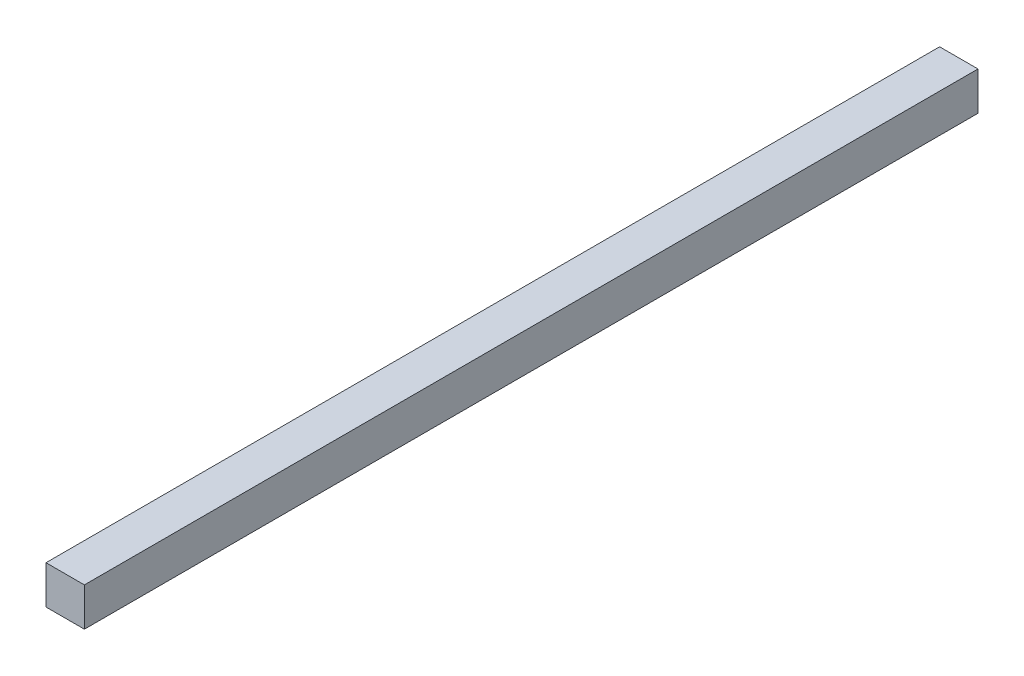
ISO-10303-21;
HEADER;
FILE_DESCRIPTION(('STEP AP214'),'2;1');
FILE_NAME('part.step','',(''),(''),'','','');
FILE_SCHEMA(('AUTOMOTIVE_DESIGN { 1 0 10303 214 1 1 1 1 }'));
ENDSEC;
DATA;
#1=APPLICATION_CONTEXT('core data for automotive mechanical design processes');
#2=APPLICATION_PROTOCOL_DEFINITION('international standard','automotive_design',2000,#1);
#3=PRODUCT_CONTEXT('',#1,'mechanical');
#4=PRODUCT('Part','Part','',(#3));
#5=PRODUCT_RELATED_PRODUCT_CATEGORY('part','',(#4));
#6=PRODUCT_DEFINITION_FORMATION('','',#4);
#7=PRODUCT_DEFINITION_CONTEXT('part definition',#1,'design');
#8=PRODUCT_DEFINITION('design','',#6,#7);
#9=PRODUCT_DEFINITION_SHAPE('','',#8);
#10=(LENGTH_UNIT() NAMED_UNIT(*) SI_UNIT(.MILLI.,.METRE.));
#11=(NAMED_UNIT(*) PLANE_ANGLE_UNIT() SI_UNIT($,.RADIAN.));
#12=(NAMED_UNIT(*) SI_UNIT($,.STERADIAN.) SOLID_ANGLE_UNIT());
#13=UNCERTAINTY_MEASURE_WITH_UNIT(LENGTH_MEASURE(1.E-05),#10,'distance_accuracy_value','');
#14=(GEOMETRIC_REPRESENTATION_CONTEXT(3) GLOBAL_UNCERTAINTY_ASSIGNED_CONTEXT((#13)) GLOBAL_UNIT_ASSIGNED_CONTEXT((#10,
#11,#12)) REPRESENTATION_CONTEXT('',''));
#15=CARTESIAN_POINT('',(0.,0.,0.));
#16=DIRECTION('',(0.,0.,1.));
#17=DIRECTION('',(1.,0.,0.));
#18=AXIS2_PLACEMENT_3D('',#15,#16,#17);
#19=CARTESIAN_POINT('',(-11.,11.,0.));
#20=DIRECTION('',(-1.,0.,0.));
#21=DIRECTION('',(0.,0.,1.));
#22=AXIS2_PLACEMENT_3D('',#19,#20,#21);
#23=PLANE('',#22);
#24=DIRECTION('',(0.,1.,0.));
#25=VECTOR('',#24,1.);
#26=CARTESIAN_POINT('',(-11.,0.,512.));
#27=LINE('',#26,#25);
#28=CARTESIAN_POINT('',(-11.,11.,512.));
#29=VERTEX_POINT('',#28);
#30=CARTESIAN_POINT('',(-11.,-11.,512.));
#31=VERTEX_POINT('',#30);
#32=EDGE_CURVE('E68',#29,#31,#27,.F.);
#33=ORIENTED_EDGE('',*,*,#32,.F.);
#34=DIRECTION('',(0.,0.,1.));
#35=VECTOR('',#34,1.);
#36=CARTESIAN_POINT('',(-11.,11.,0.));
#37=LINE('',#36,#35);
#38=CARTESIAN_POINT('',(-11.,11.,0.));
#39=VERTEX_POINT('',#38);
#40=EDGE_CURVE('E55',#39,#29,#37,.T.);
#41=ORIENTED_EDGE('',*,*,#40,.F.);
#42=DIRECTION('',(0.,1.,0.));
#43=VECTOR('',#42,1.);
#44=CARTESIAN_POINT('',(-11.,0.,0.));
#45=LINE('',#44,#43);
#46=CARTESIAN_POINT('',(-11.,-11.,0.));
#47=VERTEX_POINT('',#46);
#48=EDGE_CURVE('E20',#39,#47,#45,.F.);
#49=ORIENTED_EDGE('',*,*,#48,.T.);
#50=DIRECTION('',(0.,0.,-1.));
#51=VECTOR('',#50,1.);
#52=CARTESIAN_POINT('',(-11.,-11.,0.));
#53=LINE('',#52,#51);
#54=EDGE_CURVE('E81',#31,#47,#53,.T.);
#55=ORIENTED_EDGE('',*,*,#54,.F.);
#56=EDGE_LOOP('',(#33,#41,#49,#55));
#57=FACE_BOUND('',#56,.T.);
#58=ADVANCED_FACE('F17',(#57),#23,.T.);
#59=CARTESIAN_POINT('',(0.,0.,0.));
#60=DIRECTION('',(0.,0.,1.));
#61=DIRECTION('',(1.,0.,0.));
#62=AXIS2_PLACEMENT_3D('',#59,#60,#61);
#63=PLANE('',#62);
#64=DIRECTION('',(0.,1.,0.));
#65=VECTOR('',#64,1.);
#66=CARTESIAN_POINT('',(11.,-11.,0.));
#67=LINE('',#66,#65);
#68=CARTESIAN_POINT('',(11.,-11.,0.));
#69=VERTEX_POINT('',#68);
#70=CARTESIAN_POINT('',(11.,11.,0.));
#71=VERTEX_POINT('',#70);
#72=EDGE_CURVE('E83',#69,#71,#67,.T.);
#73=ORIENTED_EDGE('',*,*,#72,.F.);
#74=DIRECTION('',(1.,0.,0.));
#75=VECTOR('',#74,1.);
#76=CARTESIAN_POINT('',(-11.,-11.,0.));
#77=LINE('',#76,#75);
#78=EDGE_CURVE('E64',#47,#69,#77,.T.);
#79=ORIENTED_EDGE('',*,*,#78,.F.);
#80=ORIENTED_EDGE('',*,*,#48,.F.);
#81=DIRECTION('',(1.,0.,0.));
#82=VECTOR('',#81,1.);
#83=CARTESIAN_POINT('',(11.,11.,0.));
#84=LINE('',#83,#82);
#85=EDGE_CURVE('E61',#71,#39,#84,.F.);
#86=ORIENTED_EDGE('',*,*,#85,.F.);
#87=EDGE_LOOP('',(#73,#79,#80,#86));
#88=FACE_BOUND('',#87,.T.);
#89=ADVANCED_FACE('F60',(#88),#63,.F.);
#90=CARTESIAN_POINT('',(11.,11.,0.));
#91=DIRECTION('',(0.,1.,0.));
#92=DIRECTION('',(0.,0.,1.));
#93=AXIS2_PLACEMENT_3D('',#90,#91,#92);
#94=PLANE('',#93);
#95=DIRECTION('',(1.,0.,0.));
#96=VECTOR('',#95,1.);
#97=CARTESIAN_POINT('',(0.,11.,512.));
#98=LINE('',#97,#96);
#99=CARTESIAN_POINT('',(11.,11.,512.));
#100=VERTEX_POINT('',#99);
#101=EDGE_CURVE('E70',#100,#29,#98,.F.);
#102=ORIENTED_EDGE('',*,*,#101,.F.);
#103=DIRECTION('',(0.,0.,1.));
#104=VECTOR('',#103,1.);
#105=CARTESIAN_POINT('',(11.,11.,0.));
#106=LINE('',#105,#104);
#107=EDGE_CURVE('E74',#71,#100,#106,.T.);
#108=ORIENTED_EDGE('',*,*,#107,.F.);
#109=ORIENTED_EDGE('',*,*,#85,.T.);
#110=ORIENTED_EDGE('',*,*,#40,.T.);
#111=EDGE_LOOP('',(#102,#108,#109,#110));
#112=FACE_BOUND('',#111,.T.);
#113=ADVANCED_FACE('F72',(#112),#94,.T.);
#114=CARTESIAN_POINT('',(0.,0.,512.));
#115=DIRECTION('',(0.,0.,1.));
#116=DIRECTION('',(1.,0.,0.));
#117=AXIS2_PLACEMENT_3D('',#114,#115,#116);
#118=PLANE('',#117);
#119=DIRECTION('',(1.,0.,0.));
#120=VECTOR('',#119,1.);
#121=CARTESIAN_POINT('',(-11.,-11.,512.));
#122=LINE('',#121,#120);
#123=CARTESIAN_POINT('',(11.,-11.,512.));
#124=VERTEX_POINT('',#123);
#125=EDGE_CURVE('E35',#124,#31,#122,.F.);
#126=ORIENTED_EDGE('',*,*,#125,.F.);
#127=DIRECTION('',(0.,1.,0.));
#128=VECTOR('',#127,1.);
#129=CARTESIAN_POINT('',(11.,-11.,512.));
#130=LINE('',#129,#128);
#131=EDGE_CURVE('E26',#100,#124,#130,.F.);
#132=ORIENTED_EDGE('',*,*,#131,.F.);
#133=ORIENTED_EDGE('',*,*,#101,.T.);
#134=ORIENTED_EDGE('',*,*,#32,.T.);
#135=EDGE_LOOP('',(#126,#132,#133,#134));
#136=FACE_BOUND('',#135,.T.);
#137=ADVANCED_FACE('F89',(#136),#118,.T.);
#138=CARTESIAN_POINT('',(-11.,-11.,0.));
#139=DIRECTION('',(0.,-1.,0.));
#140=DIRECTION('',(0.,0.,-1.));
#141=AXIS2_PLACEMENT_3D('',#138,#139,#140);
#142=PLANE('',#141);
#143=ORIENTED_EDGE('',*,*,#125,.T.);
#144=ORIENTED_EDGE('',*,*,#54,.T.);
#145=ORIENTED_EDGE('',*,*,#78,.T.);
#146=DIRECTION('',(0.,0.,1.));
#147=VECTOR('',#146,1.);
#148=CARTESIAN_POINT('',(11.,-11.,0.));
#149=LINE('',#148,#147);
#150=EDGE_CURVE('E11',#124,#69,#149,.F.);
#151=ORIENTED_EDGE('',*,*,#150,.F.);
#152=EDGE_LOOP('',(#143,#144,#145,#151));
#153=FACE_BOUND('',#152,.T.);
#154=ADVANCED_FACE('F91',(#153),#142,.T.);
#155=CARTESIAN_POINT('',(11.,-11.,0.));
#156=DIRECTION('',(1.,0.,0.));
#157=DIRECTION('',(0.,1.,0.));
#158=AXIS2_PLACEMENT_3D('',#155,#156,#157);
#159=PLANE('',#158);
#160=ORIENTED_EDGE('',*,*,#131,.T.);
#161=ORIENTED_EDGE('',*,*,#150,.T.);
#162=ORIENTED_EDGE('',*,*,#72,.T.);
#163=ORIENTED_EDGE('',*,*,#107,.T.);
#164=EDGE_LOOP('',(#160,#161,#162,#163));
#165=FACE_BOUND('',#164,.T.);
#166=ADVANCED_FACE('F88',(#165),#159,.T.);
#167=CLOSED_SHELL('',(#58,#89,#113,#137,#154,#166));
#168=MANIFOLD_SOLID_BREP('B1',#167);
#169=ADVANCED_BREP_SHAPE_REPRESENTATION('',(#18,#168),#14);
#170=SHAPE_DEFINITION_REPRESENTATION(#9,#169);
ENDSEC;
END-ISO-10303-21;
